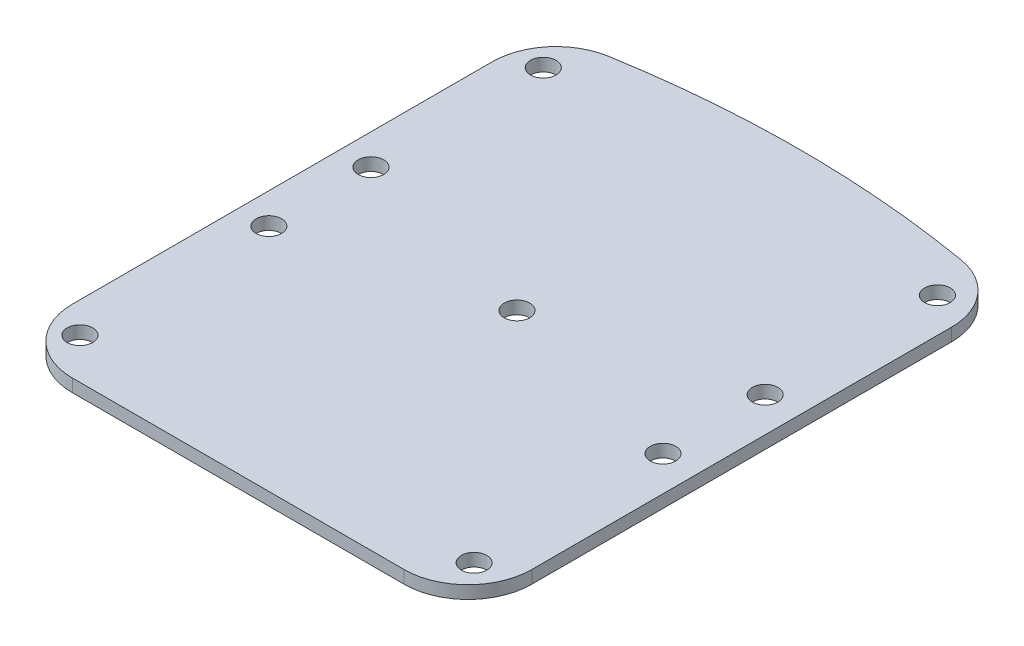
ISO-10303-21;
HEADER;
FILE_DESCRIPTION(('STEP AP214'),'2;1');
FILE_NAME('part.step','',(''),(''),'','','');
FILE_SCHEMA(('AUTOMOTIVE_DESIGN { 1 0 10303 214 1 1 1 1 }'));
ENDSEC;
DATA;
#1=APPLICATION_CONTEXT('core data for automotive mechanical design processes');
#2=APPLICATION_PROTOCOL_DEFINITION('international standard','automotive_design',2000,#1);
#3=PRODUCT_CONTEXT('',#1,'mechanical');
#4=PRODUCT('Part','Part','',(#3));
#5=PRODUCT_RELATED_PRODUCT_CATEGORY('part','',(#4));
#6=PRODUCT_DEFINITION_FORMATION('','',#4);
#7=PRODUCT_DEFINITION_CONTEXT('part definition',#1,'design');
#8=PRODUCT_DEFINITION('design','',#6,#7);
#9=PRODUCT_DEFINITION_SHAPE('','',#8);
#10=(LENGTH_UNIT() NAMED_UNIT(*) SI_UNIT(.MILLI.,.METRE.));
#11=(NAMED_UNIT(*) PLANE_ANGLE_UNIT() SI_UNIT($,.RADIAN.));
#12=(NAMED_UNIT(*) SI_UNIT($,.STERADIAN.) SOLID_ANGLE_UNIT());
#13=UNCERTAINTY_MEASURE_WITH_UNIT(LENGTH_MEASURE(1.E-05),#10,'distance_accuracy_value','');
#14=(GEOMETRIC_REPRESENTATION_CONTEXT(3) GLOBAL_UNCERTAINTY_ASSIGNED_CONTEXT((#13)) GLOBAL_UNIT_ASSIGNED_CONTEXT((#10,
#11,#12)) REPRESENTATION_CONTEXT('',''));
#15=CARTESIAN_POINT('',(0.,0.,0.));
#16=DIRECTION('',(0.,0.,1.));
#17=DIRECTION('',(1.,0.,0.));
#18=AXIS2_PLACEMENT_3D('',#15,#16,#17);
#19=CARTESIAN_POINT('',(-64.2023522859784,5.,-79.4733192202054));
#20=DIRECTION('',(0.,-1.,0.));
#21=DIRECTION('',(0.,0.,-1.));
#22=AXIS2_PLACEMENT_3D('',#19,#20,#21);
#23=CYLINDRICAL_SURFACE('',#22,25.);
#24=CARTESIAN_POINT('',(-64.2023522859784,0.,-79.4733192202054));
#25=DIRECTION('',(0.,1.,0.));
#26=DIRECTION('',(0.,0.,1.));
#27=AXIS2_PLACEMENT_3D('',#24,#25,#26);
#28=CIRCLE('',#27,25.);
#29=CARTESIAN_POINT('',(-89.2023522859784,0.,-79.4733192202054));
#30=VERTEX_POINT('',#29);
#31=CARTESIAN_POINT('',(-68.4209252071058,0.,-104.11482166038));
#32=VERTEX_POINT('',#31);
#33=EDGE_CURVE('E134',#30,#32,#28,.F.);
#34=ORIENTED_EDGE('',*,*,#33,.F.);
#35=DIRECTION('',(0.,-1.,0.));
#36=VECTOR('',#35,1.);
#37=CARTESIAN_POINT('',(-89.2023522859784,5.,-79.4733192202054));
#38=LINE('',#37,#36);
#39=CARTESIAN_POINT('',(-89.2023522859784,5.,-79.4733192202054));
#40=VERTEX_POINT('',#39);
#41=EDGE_CURVE('E11',#40,#30,#38,.T.);
#42=ORIENTED_EDGE('',*,*,#41,.F.);
#43=CARTESIAN_POINT('',(-64.2023522859784,5.,-79.4733192202054));
#44=DIRECTION('',(0.,1.,0.));
#45=DIRECTION('',(0.,0.,1.));
#46=AXIS2_PLACEMENT_3D('',#43,#44,#45);
#47=CIRCLE('',#46,25.);
#48=CARTESIAN_POINT('',(-68.4209252071058,5.,-104.11482166038));
#49=VERTEX_POINT('',#48);
#50=EDGE_CURVE('E153',#40,#49,#47,.F.);
#51=ORIENTED_EDGE('',*,*,#50,.T.);
#52=DIRECTION('',(0.,-1.,0.));
#53=VECTOR('',#52,1.);
#54=CARTESIAN_POINT('',(-68.4209252071058,5.,-104.11482166038));
#55=LINE('',#54,#53);
#56=EDGE_CURVE('E55',#49,#32,#55,.T.);
#57=ORIENTED_EDGE('',*,*,#56,.T.);
#58=EDGE_LOOP('',(#34,#42,#51,#57));
#59=FACE_BOUND('',#58,.T.);
#60=ADVANCED_FACE('F37',(#59),#23,.T.);
#61=CARTESIAN_POINT('',(-89.2023522859784,5.,0.));
#62=DIRECTION('',(1.,0.,0.));
#63=DIRECTION('',(0.,0.,-1.));
#64=AXIS2_PLACEMENT_3D('',#61,#62,#63);
#65=PLANE('',#64);
#66=DIRECTION('',(0.,0.,1.));
#67=VECTOR('',#66,1.);
#68=CARTESIAN_POINT('',(-89.2023522859784,0.,0.));
#69=LINE('',#68,#67);
#70=CARTESIAN_POINT('',(-89.2023522859784,0.,85.));
#71=VERTEX_POINT('',#70);
#72=EDGE_CURVE('E136',#30,#71,#69,.T.);
#73=ORIENTED_EDGE('',*,*,#72,.T.);
#74=DIRECTION('',(0.,-1.,0.));
#75=VECTOR('',#74,1.);
#76=CARTESIAN_POINT('',(-89.2023522859784,5.,85.));
#77=LINE('',#76,#75);
#78=CARTESIAN_POINT('',(-89.2023522859784,5.,85.));
#79=VERTEX_POINT('',#78);
#80=EDGE_CURVE('E46',#79,#71,#77,.T.);
#81=ORIENTED_EDGE('',*,*,#80,.F.);
#82=DIRECTION('',(0.,0.,1.));
#83=VECTOR('',#82,1.);
#84=CARTESIAN_POINT('',(-89.2023522859784,5.,0.));
#85=LINE('',#84,#83);
#86=EDGE_CURVE('E250',#40,#79,#85,.T.);
#87=ORIENTED_EDGE('',*,*,#86,.F.);
#88=ORIENTED_EDGE('',*,*,#41,.T.);
#89=EDGE_LOOP('',(#73,#81,#87,#88));
#90=FACE_BOUND('',#89,.T.);
#91=ADVANCED_FACE('F207',(#90),#65,.F.);
#92=CARTESIAN_POINT('',(-64.2023522859784,5.,85.));
#93=DIRECTION('',(0.,-1.,0.));
#94=DIRECTION('',(0.,0.,-1.));
#95=AXIS2_PLACEMENT_3D('',#92,#93,#94);
#96=CYLINDRICAL_SURFACE('',#95,25.);
#97=CARTESIAN_POINT('',(-64.2023522859784,0.,85.));
#98=DIRECTION('',(0.,1.,0.));
#99=DIRECTION('',(0.,0.,1.));
#100=AXIS2_PLACEMENT_3D('',#97,#98,#99);
#101=CIRCLE('',#100,25.);
#102=CARTESIAN_POINT('',(-64.2023522859784,0.,110.));
#103=VERTEX_POINT('',#102);
#104=EDGE_CURVE('E139',#103,#71,#101,.F.);
#105=ORIENTED_EDGE('',*,*,#104,.F.);
#106=DIRECTION('',(0.,-1.,0.));
#107=VECTOR('',#106,1.);
#108=CARTESIAN_POINT('',(-64.2023522859784,5.,110.));
#109=LINE('',#108,#107);
#110=CARTESIAN_POINT('',(-64.2023522859784,5.,110.));
#111=VERTEX_POINT('',#110);
#112=EDGE_CURVE('E160',#111,#103,#109,.T.);
#113=ORIENTED_EDGE('',*,*,#112,.F.);
#114=CARTESIAN_POINT('',(-64.2023522859784,5.,85.));
#115=DIRECTION('',(0.,1.,0.));
#116=DIRECTION('',(0.,0.,1.));
#117=AXIS2_PLACEMENT_3D('',#114,#115,#116);
#118=CIRCLE('',#117,25.);
#119=EDGE_CURVE('E249',#111,#79,#118,.F.);
#120=ORIENTED_EDGE('',*,*,#119,.T.);
#121=ORIENTED_EDGE('',*,*,#80,.T.);
#122=EDGE_LOOP('',(#105,#113,#120,#121));
#123=FACE_BOUND('',#122,.T.);
#124=ADVANCED_FACE('F211',(#123),#96,.T.);
#125=CARTESIAN_POINT('',(0.,5.,110.));
#126=DIRECTION('',(0.,0.,-1.));
#127=DIRECTION('',(-1.,0.,0.));
#128=AXIS2_PLACEMENT_3D('',#125,#126,#127);
#129=PLANE('',#128);
#130=DIRECTION('',(1.,0.,0.));
#131=VECTOR('',#130,1.);
#132=CARTESIAN_POINT('',(0.,0.,110.));
#133=LINE('',#132,#131);
#134=CARTESIAN_POINT('',(65.7976477140216,0.,110.));
#135=VERTEX_POINT('',#134);
#136=EDGE_CURVE('E142',#103,#135,#133,.T.);
#137=ORIENTED_EDGE('',*,*,#136,.T.);
#138=DIRECTION('',(0.,-1.,0.));
#139=VECTOR('',#138,1.);
#140=CARTESIAN_POINT('',(65.7976477140216,5.,110.));
#141=LINE('',#140,#139);
#142=CARTESIAN_POINT('',(65.7976477140216,5.,110.));
#143=VERTEX_POINT('',#142);
#144=EDGE_CURVE('E157',#143,#135,#141,.T.);
#145=ORIENTED_EDGE('',*,*,#144,.F.);
#146=DIRECTION('',(1.,0.,0.));
#147=VECTOR('',#146,1.);
#148=CARTESIAN_POINT('',(0.,5.,110.));
#149=LINE('',#148,#147);
#150=EDGE_CURVE('E129',#111,#143,#149,.T.);
#151=ORIENTED_EDGE('',*,*,#150,.F.);
#152=ORIENTED_EDGE('',*,*,#112,.T.);
#153=EDGE_LOOP('',(#137,#145,#151,#152));
#154=FACE_BOUND('',#153,.T.);
#155=ADVANCED_FACE('F232',(#154),#129,.F.);
#156=CARTESIAN_POINT('',(65.7976477140216,5.,85.));
#157=DIRECTION('',(0.,-1.,0.));
#158=DIRECTION('',(0.,0.,-1.));
#159=AXIS2_PLACEMENT_3D('',#156,#157,#158);
#160=CYLINDRICAL_SURFACE('',#159,25.);
#161=CARTESIAN_POINT('',(65.7976477140216,0.,85.));
#162=DIRECTION('',(0.,1.,0.));
#163=DIRECTION('',(0.,0.,1.));
#164=AXIS2_PLACEMENT_3D('',#161,#162,#163);
#165=CIRCLE('',#164,25.);
#166=CARTESIAN_POINT('',(90.7976477140216,0.,85.));
#167=VERTEX_POINT('',#166);
#168=EDGE_CURVE('E144',#135,#167,#165,.T.);
#169=ORIENTED_EDGE('',*,*,#168,.T.);
#170=DIRECTION('',(0.,-1.,0.));
#171=VECTOR('',#170,1.);
#172=CARTESIAN_POINT('',(90.7976477140216,5.,85.));
#173=LINE('',#172,#171);
#174=CARTESIAN_POINT('',(90.7976477140216,5.,85.));
#175=VERTEX_POINT('',#174);
#176=EDGE_CURVE('E115',#175,#167,#173,.T.);
#177=ORIENTED_EDGE('',*,*,#176,.F.);
#178=CARTESIAN_POINT('',(65.7976477140216,5.,85.));
#179=DIRECTION('',(0.,1.,0.));
#180=DIRECTION('',(0.,0.,1.));
#181=AXIS2_PLACEMENT_3D('',#178,#179,#180);
#182=CIRCLE('',#181,25.);
#183=EDGE_CURVE('E126',#143,#175,#182,.T.);
#184=ORIENTED_EDGE('',*,*,#183,.F.);
#185=ORIENTED_EDGE('',*,*,#144,.T.);
#186=EDGE_LOOP('',(#169,#177,#184,#185));
#187=FACE_BOUND('',#186,.T.);
#188=ADVANCED_FACE('F229',(#187),#160,.T.);
#189=CARTESIAN_POINT('',(90.7976477140216,5.,0.));
#190=DIRECTION('',(1.,0.,0.));
#191=DIRECTION('',(0.,0.,-1.));
#192=AXIS2_PLACEMENT_3D('',#189,#190,#191);
#193=PLANE('',#192);
#194=DIRECTION('',(0.,0.,1.));
#195=VECTOR('',#194,1.);
#196=CARTESIAN_POINT('',(90.7976477140216,0.,0.));
#197=LINE('',#196,#195);
#198=CARTESIAN_POINT('',(90.7976477140216,0.,-79.4616793717698));
#199=VERTEX_POINT('',#198);
#200=EDGE_CURVE('E112',#199,#167,#197,.T.);
#201=ORIENTED_EDGE('',*,*,#200,.F.);
#202=DIRECTION('',(0.,-1.,0.));
#203=VECTOR('',#202,1.);
#204=CARTESIAN_POINT('',(90.7976477140216,5.,-79.4616793717698));
#205=LINE('',#204,#203);
#206=CARTESIAN_POINT('',(90.7976477140216,5.,-79.4616793717698));
#207=VERTEX_POINT('',#206);
#208=EDGE_CURVE('E106',#207,#199,#205,.T.);
#209=ORIENTED_EDGE('',*,*,#208,.F.);
#210=DIRECTION('',(0.,0.,1.));
#211=VECTOR('',#210,1.);
#212=CARTESIAN_POINT('',(90.7976477140216,5.,0.));
#213=LINE('',#212,#211);
#214=EDGE_CURVE('E110',#207,#175,#213,.T.);
#215=ORIENTED_EDGE('',*,*,#214,.T.);
#216=ORIENTED_EDGE('',*,*,#176,.T.);
#217=EDGE_LOOP('',(#201,#209,#215,#216));
#218=FACE_BOUND('',#217,.T.);
#219=ADVANCED_FACE('F108',(#218),#193,.T.);
#220=CARTESIAN_POINT('',(65.7976477140216,5.,-79.4616793717698));
#221=DIRECTION('',(0.,-1.,0.));
#222=DIRECTION('',(0.,0.,-1.));
#223=AXIS2_PLACEMENT_3D('',#220,#221,#222);
#224=CYLINDRICAL_SURFACE('',#223,25.);
#225=CARTESIAN_POINT('',(65.7976477140216,0.,-79.4616793717698));
#226=DIRECTION('',(0.,1.,0.));
#227=DIRECTION('',(0.,0.,1.));
#228=AXIS2_PLACEMENT_3D('',#225,#226,#227);
#229=CIRCLE('',#228,25.);
#230=CARTESIAN_POINT('',(70.0206332344526,0.,-104.10242597763));
#231=VERTEX_POINT('',#230);
#232=EDGE_CURVE('E148',#199,#231,#229,.T.);
#233=ORIENTED_EDGE('',*,*,#232,.T.);
#234=DIRECTION('',(0.,-1.,0.));
#235=VECTOR('',#234,1.);
#236=CARTESIAN_POINT('',(70.0206332344526,5.,-104.10242597763));
#237=LINE('',#236,#235);
#238=CARTESIAN_POINT('',(70.0206332344526,5.,-104.10242597763));
#239=VERTEX_POINT('',#238);
#240=EDGE_CURVE('E81',#239,#231,#237,.T.);
#241=ORIENTED_EDGE('',*,*,#240,.F.);
#242=CARTESIAN_POINT('',(65.7976477140216,5.,-79.4616793717698));
#243=DIRECTION('',(0.,1.,0.));
#244=DIRECTION('',(0.,0.,1.));
#245=AXIS2_PLACEMENT_3D('',#242,#243,#244);
#246=CIRCLE('',#245,25.);
#247=EDGE_CURVE('E117',#207,#239,#246,.T.);
#248=ORIENTED_EDGE('',*,*,#247,.F.);
#249=ORIENTED_EDGE('',*,*,#208,.T.);
#250=EDGE_LOOP('',(#233,#241,#248,#249));
#251=FACE_BOUND('',#250,.T.);
#252=ADVANCED_FACE('F118',(#251),#224,.T.);
#253=CARTESIAN_POINT('',(0.763670699384128,5.,300.00581835849));
#254=DIRECTION('',(0.,-1.,0.));
#255=DIRECTION('',(0.,0.,-1.));
#256=AXIS2_PLACEMENT_3D('',#253,#254,#255);
#257=CYLINDRICAL_SURFACE('',#256,410.000000000006);
#258=CARTESIAN_POINT('',(0.763670699384128,0.,300.00581835849));
#259=DIRECTION('',(0.,1.,0.));
#260=DIRECTION('',(0.,0.,1.));
#261=AXIS2_PLACEMENT_3D('',#258,#259,#260);
#262=CIRCLE('',#261,410.000000000006);
#263=EDGE_CURVE('E150',#32,#231,#262,.F.);
#264=ORIENTED_EDGE('',*,*,#263,.F.);
#265=ORIENTED_EDGE('',*,*,#56,.F.);
#266=CARTESIAN_POINT('',(0.763670699384128,5.,300.00581835849));
#267=DIRECTION('',(0.,1.,0.));
#268=DIRECTION('',(0.,0.,1.));
#269=AXIS2_PLACEMENT_3D('',#266,#267,#268);
#270=CIRCLE('',#269,410.000000000006);
#271=EDGE_CURVE('E121',#49,#239,#270,.F.);
#272=ORIENTED_EDGE('',*,*,#271,.T.);
#273=ORIENTED_EDGE('',*,*,#240,.T.);
#274=EDGE_LOOP('',(#264,#265,#272,#273));
#275=FACE_BOUND('',#274,.T.);
#276=ADVANCED_FACE('F215',(#275),#257,.T.);
#277=CARTESIAN_POINT('',(0.,5.,0.));
#278=DIRECTION('',(0.,1.,0.));
#279=DIRECTION('',(0.,0.,1.));
#280=AXIS2_PLACEMENT_3D('',#277,#278,#279);
#281=PLANE('',#280);
#282=CARTESIAN_POINT('',(77.2023522859784,5.,-87.5));
#283=DIRECTION('',(0.,1.,0.));
#284=DIRECTION('',(0.,0.,-1.));
#285=AXIS2_PLACEMENT_3D('',#282,#283,#284);
#286=CIRCLE('',#285,5.00000000000001);
#287=CARTESIAN_POINT('',(77.2023522859784,5.,-92.5));
#288=VERTEX_POINT('',#287);
#289=EDGE_CURVE('E258',#288,#288,#286,.T.);
#290=ORIENTED_EDGE('',*,*,#289,.F.);
#291=EDGE_LOOP('',(#290));
#292=FACE_BOUND('',#291,.T.);
#293=CARTESIAN_POINT('',(77.2023522859784,5.,-20.));
#294=DIRECTION('',(0.,1.,0.));
#295=DIRECTION('',(0.,0.,-1.));
#296=AXIS2_PLACEMENT_3D('',#293,#294,#295);
#297=CIRCLE('',#296,5.);
#298=CARTESIAN_POINT('',(77.2023522859784,5.,-25.));
#299=VERTEX_POINT('',#298);
#300=EDGE_CURVE('E260',#299,#299,#297,.T.);
#301=ORIENTED_EDGE('',*,*,#300,.F.);
#302=EDGE_LOOP('',(#301));
#303=FACE_BOUND('',#302,.T.);
#304=CARTESIAN_POINT('',(77.2023522859784,5.,20.));
#305=DIRECTION('',(0.,1.,0.));
#306=DIRECTION('',(0.,0.,-1.));
#307=AXIS2_PLACEMENT_3D('',#304,#305,#306);
#308=CIRCLE('',#307,5.);
#309=CARTESIAN_POINT('',(77.2023522859784,5.,15.));
#310=VERTEX_POINT('',#309);
#311=EDGE_CURVE('E263',#310,#310,#308,.T.);
#312=ORIENTED_EDGE('',*,*,#311,.F.);
#313=EDGE_LOOP('',(#312));
#314=FACE_BOUND('',#313,.T.);
#315=CARTESIAN_POINT('',(77.2023522859784,5.,93.9999999999999));
#316=DIRECTION('',(0.,1.,0.));
#317=DIRECTION('',(0.,0.,-1.));
#318=AXIS2_PLACEMENT_3D('',#315,#316,#317);
#319=CIRCLE('',#318,5.00000000000001);
#320=CARTESIAN_POINT('',(77.2023522859784,5.,88.9999999999999));
#321=VERTEX_POINT('',#320);
#322=EDGE_CURVE('E266',#321,#321,#319,.T.);
#323=ORIENTED_EDGE('',*,*,#322,.F.);
#324=EDGE_LOOP('',(#323));
#325=FACE_BOUND('',#324,.T.);
#326=CARTESIAN_POINT('',(-77.2023522859784,5.,20.));
#327=DIRECTION('',(0.,1.,0.));
#328=DIRECTION('',(0.,0.,1.));
#329=AXIS2_PLACEMENT_3D('',#326,#327,#328);
#330=CIRCLE('',#329,5.);
#331=CARTESIAN_POINT('',(-77.2023522859784,5.,25.));
#332=VERTEX_POINT('',#331);
#333=EDGE_CURVE('E257',#332,#332,#330,.T.);
#334=ORIENTED_EDGE('',*,*,#333,.F.);
#335=EDGE_LOOP('',(#334));
#336=FACE_BOUND('',#335,.T.);
#337=CARTESIAN_POINT('',(-77.2023522859784,5.,-87.5));
#338=DIRECTION('',(0.,1.,0.));
#339=DIRECTION('',(0.,0.,1.));
#340=AXIS2_PLACEMENT_3D('',#337,#338,#339);
#341=CIRCLE('',#340,5.00000000000001);
#342=CARTESIAN_POINT('',(-77.2023522859784,5.,-82.5));
#343=VERTEX_POINT('',#342);
#344=EDGE_CURVE('E270',#343,#343,#341,.T.);
#345=ORIENTED_EDGE('',*,*,#344,.F.);
#346=EDGE_LOOP('',(#345));
#347=FACE_BOUND('',#346,.T.);
#348=CARTESIAN_POINT('',(-77.2023522859784,5.,94.));
#349=DIRECTION('',(0.,1.,0.));
#350=DIRECTION('',(0.,0.,1.));
#351=AXIS2_PLACEMENT_3D('',#348,#349,#350);
#352=CIRCLE('',#351,5.00000000000001);
#353=CARTESIAN_POINT('',(-77.2023522859784,5.,99.));
#354=VERTEX_POINT('',#353);
#355=EDGE_CURVE('E273',#354,#354,#352,.T.);
#356=ORIENTED_EDGE('',*,*,#355,.F.);
#357=EDGE_LOOP('',(#356));
#358=FACE_BOUND('',#357,.T.);
#359=CARTESIAN_POINT('',(0.,5.,0.));
#360=DIRECTION('',(0.,1.,0.));
#361=DIRECTION('',(0.,0.,1.));
#362=AXIS2_PLACEMENT_3D('',#359,#360,#361);
#363=CIRCLE('',#362,5.);
#364=CARTESIAN_POINT('',(0.,5.,5.));
#365=VERTEX_POINT('',#364);
#366=EDGE_CURVE('E269',#365,#365,#363,.T.);
#367=ORIENTED_EDGE('',*,*,#366,.F.);
#368=EDGE_LOOP('',(#367));
#369=FACE_BOUND('',#368,.T.);
#370=CARTESIAN_POINT('',(-77.2023522859784,5.,-20.));
#371=DIRECTION('',(0.,1.,0.));
#372=DIRECTION('',(0.,0.,1.));
#373=AXIS2_PLACEMENT_3D('',#370,#371,#372);
#374=CIRCLE('',#373,5.);
#375=CARTESIAN_POINT('',(-77.2023522859784,5.,-15.));
#376=VERTEX_POINT('',#375);
#377=EDGE_CURVE('E167',#376,#376,#374,.T.);
#378=ORIENTED_EDGE('',*,*,#377,.F.);
#379=EDGE_LOOP('',(#378));
#380=FACE_BOUND('',#379,.T.);
#381=ORIENTED_EDGE('',*,*,#50,.F.);
#382=ORIENTED_EDGE('',*,*,#86,.T.);
#383=ORIENTED_EDGE('',*,*,#119,.F.);
#384=ORIENTED_EDGE('',*,*,#150,.T.);
#385=ORIENTED_EDGE('',*,*,#183,.T.);
#386=ORIENTED_EDGE('',*,*,#214,.F.);
#387=ORIENTED_EDGE('',*,*,#247,.T.);
#388=ORIENTED_EDGE('',*,*,#271,.F.);
#389=EDGE_LOOP('',(#381,#382,#383,#384,#385,#386,#387,#388));
#390=FACE_BOUND('',#389,.T.);
#391=ADVANCED_FACE('F124',(#292,#303,#314,#325,#336,#347,#358,#369,#380,#390),#281,.T.);
#392=CARTESIAN_POINT('',(0.,0.,0.));
#393=DIRECTION('',(0.,1.,0.));
#394=DIRECTION('',(0.,0.,1.));
#395=AXIS2_PLACEMENT_3D('',#392,#393,#394);
#396=PLANE('',#395);
#397=CARTESIAN_POINT('',(77.2023522859784,0.,-87.5));
#398=DIRECTION('',(0.,1.,0.));
#399=DIRECTION('',(0.,0.,1.));
#400=AXIS2_PLACEMENT_3D('',#397,#398,#399);
#401=CIRCLE('',#400,5.00000000000001);
#402=CARTESIAN_POINT('',(77.2023522859784,0.,-82.5));
#403=VERTEX_POINT('',#402);
#404=EDGE_CURVE('E40',#403,#403,#401,.T.);
#405=ORIENTED_EDGE('',*,*,#404,.T.);
#406=EDGE_LOOP('',(#405));
#407=FACE_BOUND('',#406,.T.);
#408=CARTESIAN_POINT('',(77.2023522859784,0.,-20.));
#409=DIRECTION('',(0.,1.,0.));
#410=DIRECTION('',(0.,0.,1.));
#411=AXIS2_PLACEMENT_3D('',#408,#409,#410);
#412=CIRCLE('',#411,5.);
#413=CARTESIAN_POINT('',(77.2023522859784,0.,-15.));
#414=VERTEX_POINT('',#413);
#415=EDGE_CURVE('E184',#414,#414,#412,.T.);
#416=ORIENTED_EDGE('',*,*,#415,.T.);
#417=EDGE_LOOP('',(#416));
#418=FACE_BOUND('',#417,.T.);
#419=CARTESIAN_POINT('',(77.2023522859784,0.,20.));
#420=DIRECTION('',(0.,1.,0.));
#421=DIRECTION('',(0.,0.,1.));
#422=AXIS2_PLACEMENT_3D('',#419,#420,#421);
#423=CIRCLE('',#422,5.);
#424=CARTESIAN_POINT('',(77.2023522859784,0.,25.));
#425=VERTEX_POINT('',#424);
#426=EDGE_CURVE('E182',#425,#425,#423,.T.);
#427=ORIENTED_EDGE('',*,*,#426,.T.);
#428=EDGE_LOOP('',(#427));
#429=FACE_BOUND('',#428,.T.);
#430=CARTESIAN_POINT('',(77.2023522859784,0.,93.9999999999999));
#431=DIRECTION('',(0.,1.,0.));
#432=DIRECTION('',(0.,0.,1.));
#433=AXIS2_PLACEMENT_3D('',#430,#431,#432);
#434=CIRCLE('',#433,5.00000000000001);
#435=CARTESIAN_POINT('',(77.2023522859784,0.,98.9999999999999));
#436=VERTEX_POINT('',#435);
#437=EDGE_CURVE('E179',#436,#436,#434,.T.);
#438=ORIENTED_EDGE('',*,*,#437,.T.);
#439=EDGE_LOOP('',(#438));
#440=FACE_BOUND('',#439,.T.);
#441=CARTESIAN_POINT('',(-77.2023522859784,0.,20.));
#442=DIRECTION('',(0.,1.,0.));
#443=DIRECTION('',(0.,0.,1.));
#444=AXIS2_PLACEMENT_3D('',#441,#442,#443);
#445=CIRCLE('',#444,5.);
#446=CARTESIAN_POINT('',(-77.2023522859784,0.,25.));
#447=VERTEX_POINT('',#446);
#448=EDGE_CURVE('E176',#447,#447,#445,.T.);
#449=ORIENTED_EDGE('',*,*,#448,.T.);
#450=EDGE_LOOP('',(#449));
#451=FACE_BOUND('',#450,.T.);
#452=CARTESIAN_POINT('',(-77.2023522859784,0.,-87.5));
#453=DIRECTION('',(0.,1.,0.));
#454=DIRECTION('',(0.,0.,1.));
#455=AXIS2_PLACEMENT_3D('',#452,#453,#454);
#456=CIRCLE('',#455,5.00000000000001);
#457=CARTESIAN_POINT('',(-77.2023522859784,0.,-82.5));
#458=VERTEX_POINT('',#457);
#459=EDGE_CURVE('E173',#458,#458,#456,.T.);
#460=ORIENTED_EDGE('',*,*,#459,.T.);
#461=EDGE_LOOP('',(#460));
#462=FACE_BOUND('',#461,.T.);
#463=CARTESIAN_POINT('',(-77.2023522859784,0.,94.));
#464=DIRECTION('',(0.,1.,0.));
#465=DIRECTION('',(0.,0.,1.));
#466=AXIS2_PLACEMENT_3D('',#463,#464,#465);
#467=CIRCLE('',#466,5.00000000000001);
#468=CARTESIAN_POINT('',(-77.2023522859784,0.,99.));
#469=VERTEX_POINT('',#468);
#470=EDGE_CURVE('E170',#469,#469,#467,.T.);
#471=ORIENTED_EDGE('',*,*,#470,.T.);
#472=EDGE_LOOP('',(#471));
#473=FACE_BOUND('',#472,.T.);
#474=CARTESIAN_POINT('',(0.,0.,0.));
#475=DIRECTION('',(0.,1.,0.));
#476=DIRECTION('',(0.,0.,1.));
#477=AXIS2_PLACEMENT_3D('',#474,#475,#476);
#478=CIRCLE('',#477,5.);
#479=CARTESIAN_POINT('',(0.,0.,5.));
#480=VERTEX_POINT('',#479);
#481=EDGE_CURVE('E166',#480,#480,#478,.T.);
#482=ORIENTED_EDGE('',*,*,#481,.T.);
#483=EDGE_LOOP('',(#482));
#484=FACE_BOUND('',#483,.T.);
#485=CARTESIAN_POINT('',(-77.2023522859784,0.,-20.));
#486=DIRECTION('',(0.,1.,0.));
#487=DIRECTION('',(0.,0.,1.));
#488=AXIS2_PLACEMENT_3D('',#485,#486,#487);
#489=CIRCLE('',#488,5.);
#490=CARTESIAN_POINT('',(-77.2023522859784,0.,-15.));
#491=VERTEX_POINT('',#490);
#492=EDGE_CURVE('E163',#491,#491,#489,.T.);
#493=ORIENTED_EDGE('',*,*,#492,.T.);
#494=EDGE_LOOP('',(#493));
#495=FACE_BOUND('',#494,.T.);
#496=ORIENTED_EDGE('',*,*,#33,.T.);
#497=ORIENTED_EDGE('',*,*,#263,.T.);
#498=ORIENTED_EDGE('',*,*,#232,.F.);
#499=ORIENTED_EDGE('',*,*,#200,.T.);
#500=ORIENTED_EDGE('',*,*,#168,.F.);
#501=ORIENTED_EDGE('',*,*,#136,.F.);
#502=ORIENTED_EDGE('',*,*,#104,.T.);
#503=ORIENTED_EDGE('',*,*,#72,.F.);
#504=EDGE_LOOP('',(#496,#497,#498,#499,#500,#501,#502,#503));
#505=FACE_BOUND('',#504,.T.);
#506=ADVANCED_FACE('F191',(#407,#418,#429,#440,#451,#462,#473,#484,#495,#505),#396,.F.);
#507=CARTESIAN_POINT('',(-77.2023522859784,-5.,-20.));
#508=DIRECTION('',(0.,1.,0.));
#509=DIRECTION('',(0.,0.,1.));
#510=AXIS2_PLACEMENT_3D('',#507,#508,#509);
#511=CYLINDRICAL_SURFACE('',#510,5.);
#512=ORIENTED_EDGE('',*,*,#377,.T.);
#513=EDGE_LOOP('',(#512));
#514=FACE_BOUND('',#513,.T.);
#515=ORIENTED_EDGE('',*,*,#492,.F.);
#516=EDGE_LOOP('',(#515));
#517=FACE_BOUND('',#516,.T.);
#518=ADVANCED_FACE('F289',(#514,#517),#511,.F.);
#519=CARTESIAN_POINT('',(0.,-5.,0.));
#520=DIRECTION('',(0.,1.,0.));
#521=DIRECTION('',(0.,0.,1.));
#522=AXIS2_PLACEMENT_3D('',#519,#520,#521);
#523=CYLINDRICAL_SURFACE('',#522,5.);
#524=ORIENTED_EDGE('',*,*,#366,.T.);
#525=EDGE_LOOP('',(#524));
#526=FACE_BOUND('',#525,.T.);
#527=ORIENTED_EDGE('',*,*,#481,.F.);
#528=EDGE_LOOP('',(#527));
#529=FACE_BOUND('',#528,.T.);
#530=ADVANCED_FACE('F292',(#526,#529),#523,.F.);
#531=CARTESIAN_POINT('',(-77.2023522859784,-5.,94.));
#532=DIRECTION('',(0.,1.,0.));
#533=DIRECTION('',(0.,0.,1.));
#534=AXIS2_PLACEMENT_3D('',#531,#532,#533);
#535=CYLINDRICAL_SURFACE('',#534,5.00000000000001);
#536=ORIENTED_EDGE('',*,*,#355,.T.);
#537=EDGE_LOOP('',(#536));
#538=FACE_BOUND('',#537,.T.);
#539=ORIENTED_EDGE('',*,*,#470,.F.);
#540=EDGE_LOOP('',(#539));
#541=FACE_BOUND('',#540,.T.);
#542=ADVANCED_FACE('F281',(#538,#541),#535,.F.);
#543=CARTESIAN_POINT('',(-77.2023522859784,-5.,-87.5));
#544=DIRECTION('',(0.,1.,0.));
#545=DIRECTION('',(0.,0.,1.));
#546=AXIS2_PLACEMENT_3D('',#543,#544,#545);
#547=CYLINDRICAL_SURFACE('',#546,5.00000000000001);
#548=ORIENTED_EDGE('',*,*,#344,.T.);
#549=EDGE_LOOP('',(#548));
#550=FACE_BOUND('',#549,.T.);
#551=ORIENTED_EDGE('',*,*,#459,.F.);
#552=EDGE_LOOP('',(#551));
#553=FACE_BOUND('',#552,.T.);
#554=ADVANCED_FACE('F317',(#550,#553),#547,.F.);
#555=CARTESIAN_POINT('',(-77.2023522859784,-5.,20.));
#556=DIRECTION('',(0.,1.,0.));
#557=DIRECTION('',(0.,0.,1.));
#558=AXIS2_PLACEMENT_3D('',#555,#556,#557);
#559=CYLINDRICAL_SURFACE('',#558,5.);
#560=ORIENTED_EDGE('',*,*,#333,.T.);
#561=EDGE_LOOP('',(#560));
#562=FACE_BOUND('',#561,.T.);
#563=ORIENTED_EDGE('',*,*,#448,.F.);
#564=EDGE_LOOP('',(#563));
#565=FACE_BOUND('',#564,.T.);
#566=ADVANCED_FACE('F324',(#562,#565),#559,.F.);
#567=CARTESIAN_POINT('',(77.2023522859784,-5.,93.9999999999999));
#568=DIRECTION('',(0.,1.,0.));
#569=DIRECTION('',(0.,0.,1.));
#570=AXIS2_PLACEMENT_3D('',#567,#568,#569);
#571=CYLINDRICAL_SURFACE('',#570,5.00000000000001);
#572=ORIENTED_EDGE('',*,*,#322,.T.);
#573=EDGE_LOOP('',(#572));
#574=FACE_BOUND('',#573,.T.);
#575=ORIENTED_EDGE('',*,*,#437,.F.);
#576=EDGE_LOOP('',(#575));
#577=FACE_BOUND('',#576,.T.);
#578=ADVANCED_FACE('F332',(#574,#577),#571,.F.);
#579=CARTESIAN_POINT('',(77.2023522859784,-5.,20.));
#580=DIRECTION('',(0.,1.,0.));
#581=DIRECTION('',(0.,0.,1.));
#582=AXIS2_PLACEMENT_3D('',#579,#580,#581);
#583=CYLINDRICAL_SURFACE('',#582,5.);
#584=ORIENTED_EDGE('',*,*,#311,.T.);
#585=EDGE_LOOP('',(#584));
#586=FACE_BOUND('',#585,.T.);
#587=ORIENTED_EDGE('',*,*,#426,.F.);
#588=EDGE_LOOP('',(#587));
#589=FACE_BOUND('',#588,.T.);
#590=ADVANCED_FACE('F201',(#586,#589),#583,.F.);
#591=CARTESIAN_POINT('',(77.2023522859784,-5.,-20.));
#592=DIRECTION('',(0.,1.,0.));
#593=DIRECTION('',(0.,0.,1.));
#594=AXIS2_PLACEMENT_3D('',#591,#592,#593);
#595=CYLINDRICAL_SURFACE('',#594,5.);
#596=ORIENTED_EDGE('',*,*,#300,.T.);
#597=EDGE_LOOP('',(#596));
#598=FACE_BOUND('',#597,.T.);
#599=ORIENTED_EDGE('',*,*,#415,.F.);
#600=EDGE_LOOP('',(#599));
#601=FACE_BOUND('',#600,.T.);
#602=ADVANCED_FACE('F195',(#598,#601),#595,.F.);
#603=CARTESIAN_POINT('',(77.2023522859784,-5.,-87.5));
#604=DIRECTION('',(0.,1.,0.));
#605=DIRECTION('',(0.,0.,1.));
#606=AXIS2_PLACEMENT_3D('',#603,#604,#605);
#607=CYLINDRICAL_SURFACE('',#606,5.00000000000001);
#608=ORIENTED_EDGE('',*,*,#289,.T.);
#609=EDGE_LOOP('',(#608));
#610=FACE_BOUND('',#609,.T.);
#611=ORIENTED_EDGE('',*,*,#404,.F.);
#612=EDGE_LOOP('',(#611));
#613=FACE_BOUND('',#612,.T.);
#614=ADVANCED_FACE('F193',(#610,#613),#607,.F.);
#615=CLOSED_SHELL('',(#60,#91,#124,#155,#188,#219,#252,#276,#391,#506,#518,#530,#542,#554,#566,
#578,#590,#602,#614));
#616=MANIFOLD_SOLID_BREP('B2',#615);
#617=ADVANCED_BREP_SHAPE_REPRESENTATION('',(#18,#616),#14);
#618=SHAPE_DEFINITION_REPRESENTATION(#9,#617);
ENDSEC;
END-ISO-10303-21;
